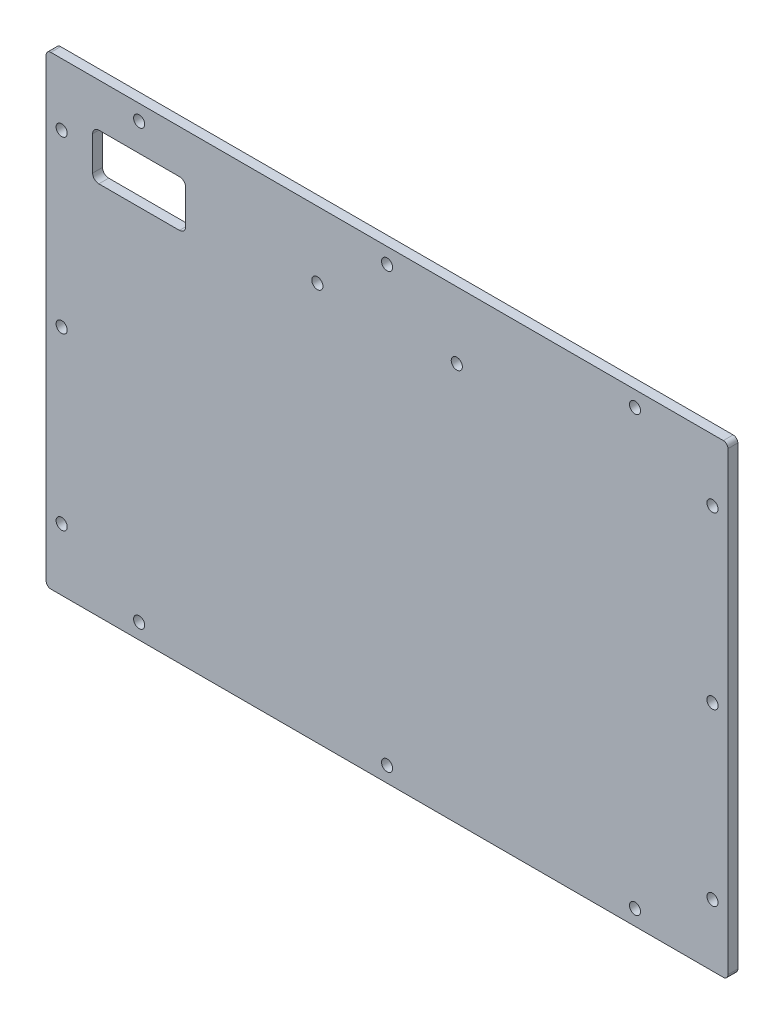
ISO-10303-21;
HEADER;
FILE_DESCRIPTION(('STEP AP214'),'2;1');
FILE_NAME('part.step','',(''),(''),'','','');
FILE_SCHEMA(('AUTOMOTIVE_DESIGN { 1 0 10303 214 1 1 1 1 }'));
ENDSEC;
DATA;
#1=APPLICATION_CONTEXT('core data for automotive mechanical design processes');
#2=APPLICATION_PROTOCOL_DEFINITION('international standard','automotive_design',2000,#1);
#3=PRODUCT_CONTEXT('',#1,'mechanical');
#4=PRODUCT('Part','Part','',(#3));
#5=PRODUCT_RELATED_PRODUCT_CATEGORY('part','',(#4));
#6=PRODUCT_DEFINITION_FORMATION('','',#4);
#7=PRODUCT_DEFINITION_CONTEXT('part definition',#1,'design');
#8=PRODUCT_DEFINITION('design','',#6,#7);
#9=PRODUCT_DEFINITION_SHAPE('','',#8);
#10=(LENGTH_UNIT() NAMED_UNIT(*) SI_UNIT(.MILLI.,.METRE.));
#11=(NAMED_UNIT(*) PLANE_ANGLE_UNIT() SI_UNIT($,.RADIAN.));
#12=(NAMED_UNIT(*) SI_UNIT($,.STERADIAN.) SOLID_ANGLE_UNIT());
#13=UNCERTAINTY_MEASURE_WITH_UNIT(LENGTH_MEASURE(1.E-05),#10,'distance_accuracy_value','');
#14=(GEOMETRIC_REPRESENTATION_CONTEXT(3) GLOBAL_UNCERTAINTY_ASSIGNED_CONTEXT((#13)) GLOBAL_UNIT_ASSIGNED_CONTEXT((#10,
#11,#12)) REPRESENTATION_CONTEXT('',''));
#15=CARTESIAN_POINT('',(0.,0.,0.));
#16=DIRECTION('',(0.,0.,1.));
#17=DIRECTION('',(1.,0.,0.));
#18=AXIS2_PLACEMENT_3D('',#15,#16,#17);
#19=CARTESIAN_POINT('',(0.,-75.,3.175));
#20=DIRECTION('',(0.,1.,0.));
#21=DIRECTION('',(0.,0.,1.));
#22=AXIS2_PLACEMENT_3D('',#19,#20,#21);
#23=PLANE('',#22);
#24=DIRECTION('',(1.,0.,0.));
#25=VECTOR('',#24,1.);
#26=CARTESIAN_POINT('',(0.,-75.,3.175));
#27=LINE('',#26,#25);
#28=CARTESIAN_POINT('',(-108.5,-75.,3.175));
#29=VERTEX_POINT('',#28);
#30=CARTESIAN_POINT('',(108.5,-75.,3.175));
#31=VERTEX_POINT('',#30);
#32=EDGE_CURVE('E171',#29,#31,#27,.T.);
#33=ORIENTED_EDGE('',*,*,#32,.F.);
#34=DIRECTION('',(0.,0.,-1.));
#35=VECTOR('',#34,1.);
#36=CARTESIAN_POINT('',(-108.5,-75.,0.));
#37=LINE('',#36,#35);
#38=CARTESIAN_POINT('',(-108.5,-75.,0.));
#39=VERTEX_POINT('',#38);
#40=EDGE_CURVE('E156',#29,#39,#37,.T.);
#41=ORIENTED_EDGE('',*,*,#40,.T.);
#42=DIRECTION('',(1.,0.,0.));
#43=VECTOR('',#42,1.);
#44=CARTESIAN_POINT('',(0.,-75.,0.));
#45=LINE('',#44,#43);
#46=CARTESIAN_POINT('',(108.5,-75.,0.));
#47=VERTEX_POINT('',#46);
#48=EDGE_CURVE('E168',#39,#47,#45,.T.);
#49=ORIENTED_EDGE('',*,*,#48,.T.);
#50=DIRECTION('',(0.,0.,-1.));
#51=VECTOR('',#50,1.);
#52=CARTESIAN_POINT('',(108.5,-75.,3.175));
#53=LINE('',#52,#51);
#54=EDGE_CURVE('E173',#47,#31,#53,.F.);
#55=ORIENTED_EDGE('',*,*,#54,.T.);
#56=EDGE_LOOP('',(#33,#41,#49,#55));
#57=FACE_BOUND('',#56,.T.);
#58=ADVANCED_FACE('F38',(#57),#23,.F.);
#59=CARTESIAN_POINT('',(110.,0.,3.175));
#60=DIRECTION('',(-1.,0.,0.));
#61=DIRECTION('',(0.,0.,1.));
#62=AXIS2_PLACEMENT_3D('',#59,#60,#61);
#63=PLANE('',#62);
#64=DIRECTION('',(0.,1.,0.));
#65=VECTOR('',#64,1.);
#66=CARTESIAN_POINT('',(110.,0.,3.175));
#67=LINE('',#66,#65);
#68=CARTESIAN_POINT('',(110.,-73.5,3.175));
#69=VERTEX_POINT('',#68);
#70=CARTESIAN_POINT('',(110.,73.5,3.175));
#71=VERTEX_POINT('',#70);
#72=EDGE_CURVE('E358',#69,#71,#67,.T.);
#73=ORIENTED_EDGE('',*,*,#72,.F.);
#74=DIRECTION('',(0.,0.,-1.));
#75=VECTOR('',#74,1.);
#76=CARTESIAN_POINT('',(110.,-73.5,3.175));
#77=LINE('',#76,#75);
#78=CARTESIAN_POINT('',(110.,-73.5,0.));
#79=VERTEX_POINT('',#78);
#80=EDGE_CURVE('E212',#69,#79,#77,.T.);
#81=ORIENTED_EDGE('',*,*,#80,.T.);
#82=DIRECTION('',(0.,1.,0.));
#83=VECTOR('',#82,1.);
#84=CARTESIAN_POINT('',(110.,0.,0.));
#85=LINE('',#84,#83);
#86=CARTESIAN_POINT('',(110.,73.5,0.));
#87=VERTEX_POINT('',#86);
#88=EDGE_CURVE('E177',#79,#87,#85,.T.);
#89=ORIENTED_EDGE('',*,*,#88,.T.);
#90=DIRECTION('',(0.,0.,-1.));
#91=VECTOR('',#90,1.);
#92=CARTESIAN_POINT('',(110.,73.5,3.175));
#93=LINE('',#92,#91);
#94=EDGE_CURVE('E210',#87,#71,#93,.F.);
#95=ORIENTED_EDGE('',*,*,#94,.T.);
#96=EDGE_LOOP('',(#73,#81,#89,#95));
#97=FACE_BOUND('',#96,.T.);
#98=ADVANCED_FACE('F383',(#97),#63,.F.);
#99=CARTESIAN_POINT('',(0.,75.,3.175));
#100=DIRECTION('',(0.,1.,0.));
#101=DIRECTION('',(0.,0.,1.));
#102=AXIS2_PLACEMENT_3D('',#99,#100,#101);
#103=PLANE('',#102);
#104=DIRECTION('',(1.,0.,0.));
#105=VECTOR('',#104,1.);
#106=CARTESIAN_POINT('',(0.,75.,3.175));
#107=LINE('',#106,#105);
#108=CARTESIAN_POINT('',(-108.5,75.,3.175));
#109=VERTEX_POINT('',#108);
#110=CARTESIAN_POINT('',(108.5,75.,3.175));
#111=VERTEX_POINT('',#110);
#112=EDGE_CURVE('E360',#109,#111,#107,.T.);
#113=ORIENTED_EDGE('',*,*,#112,.T.);
#114=DIRECTION('',(0.,0.,-1.));
#115=VECTOR('',#114,1.);
#116=CARTESIAN_POINT('',(108.5,75.,0.));
#117=LINE('',#116,#115);
#118=CARTESIAN_POINT('',(108.5,75.,0.));
#119=VERTEX_POINT('',#118);
#120=EDGE_CURVE('E217',#111,#119,#117,.T.);
#121=ORIENTED_EDGE('',*,*,#120,.T.);
#122=DIRECTION('',(1.,0.,0.));
#123=VECTOR('',#122,1.);
#124=CARTESIAN_POINT('',(0.,75.,0.));
#125=LINE('',#124,#123);
#126=CARTESIAN_POINT('',(-108.5,75.,0.));
#127=VERTEX_POINT('',#126);
#128=EDGE_CURVE('E181',#127,#119,#125,.T.);
#129=ORIENTED_EDGE('',*,*,#128,.F.);
#130=DIRECTION('',(0.,0.,-1.));
#131=VECTOR('',#130,1.);
#132=CARTESIAN_POINT('',(-108.5,75.,3.175));
#133=LINE('',#132,#131);
#134=EDGE_CURVE('E215',#127,#109,#133,.F.);
#135=ORIENTED_EDGE('',*,*,#134,.T.);
#136=EDGE_LOOP('',(#113,#121,#129,#135));
#137=FACE_BOUND('',#136,.T.);
#138=ADVANCED_FACE('F376',(#137),#103,.T.);
#139=CARTESIAN_POINT('',(-110.,0.,3.175));
#140=DIRECTION('',(-1.,0.,0.));
#141=DIRECTION('',(0.,0.,1.));
#142=AXIS2_PLACEMENT_3D('',#139,#140,#141);
#143=PLANE('',#142);
#144=DIRECTION('',(0.,1.,0.));
#145=VECTOR('',#144,1.);
#146=CARTESIAN_POINT('',(-110.,0.,0.));
#147=LINE('',#146,#145);
#148=CARTESIAN_POINT('',(-110.,-73.5,0.));
#149=VERTEX_POINT('',#148);
#150=CARTESIAN_POINT('',(-110.,73.5,0.));
#151=VERTEX_POINT('',#150);
#152=EDGE_CURVE('E192',#149,#151,#147,.T.);
#153=ORIENTED_EDGE('',*,*,#152,.F.);
#154=DIRECTION('',(0.,0.,-1.));
#155=VECTOR('',#154,1.);
#156=CARTESIAN_POINT('',(-110.,-73.5,3.175));
#157=LINE('',#156,#155);
#158=CARTESIAN_POINT('',(-110.,-73.5,3.175));
#159=VERTEX_POINT('',#158);
#160=EDGE_CURVE('E157',#149,#159,#157,.F.);
#161=ORIENTED_EDGE('',*,*,#160,.T.);
#162=DIRECTION('',(0.,1.,0.));
#163=VECTOR('',#162,1.);
#164=CARTESIAN_POINT('',(-110.,0.,3.175));
#165=LINE('',#164,#163);
#166=CARTESIAN_POINT('',(-110.,73.5,3.175));
#167=VERTEX_POINT('',#166);
#168=EDGE_CURVE('E187',#159,#167,#165,.T.);
#169=ORIENTED_EDGE('',*,*,#168,.T.);
#170=DIRECTION('',(0.,0.,-1.));
#171=VECTOR('',#170,1.);
#172=CARTESIAN_POINT('',(-110.,73.5,3.175));
#173=LINE('',#172,#171);
#174=EDGE_CURVE('E162',#167,#151,#173,.T.);
#175=ORIENTED_EDGE('',*,*,#174,.T.);
#176=EDGE_LOOP('',(#153,#161,#169,#175));
#177=FACE_BOUND('',#176,.T.);
#178=ADVANCED_FACE('F369',(#177),#143,.T.);
#179=CARTESIAN_POINT('',(0.,0.,3.175));
#180=DIRECTION('',(0.,0.,1.));
#181=DIRECTION('',(1.,0.,0.));
#182=AXIS2_PLACEMENT_3D('',#179,#180,#181);
#183=PLANE('',#182);
#184=CARTESIAN_POINT('',(-22.5,53.5,3.175));
#185=DIRECTION('',(0.,0.,1.));
#186=DIRECTION('',(1.,0.,0.));
#187=AXIS2_PLACEMENT_3D('',#184,#185,#186);
#188=CIRCLE('',#187,1.79999999999999);
#189=CARTESIAN_POINT('',(-20.7,53.5,3.175));
#190=VERTEX_POINT('',#189);
#191=EDGE_CURVE('E643',#190,#190,#188,.T.);
#192=ORIENTED_EDGE('',*,*,#191,.F.);
#193=EDGE_LOOP('',(#192));
#194=FACE_BOUND('',#193,.T.);
#195=CARTESIAN_POINT('',(22.5,53.5,3.175));
#196=DIRECTION('',(0.,0.,1.));
#197=DIRECTION('',(1.,0.,0.));
#198=AXIS2_PLACEMENT_3D('',#195,#196,#197);
#199=CIRCLE('',#198,1.79999999999999);
#200=CARTESIAN_POINT('',(24.3,53.5,3.175));
#201=VERTEX_POINT('',#200);
#202=EDGE_CURVE('E639',#201,#201,#199,.T.);
#203=ORIENTED_EDGE('',*,*,#202,.F.);
#204=EDGE_LOOP('',(#203));
#205=FACE_BOUND('',#204,.T.);
#206=DIRECTION('',(0.,1.,0.));
#207=VECTOR('',#206,1.);
#208=CARTESIAN_POINT('',(-65.,46.,3.175));
#209=LINE('',#208,#207);
#210=CARTESIAN_POINT('',(-65.,48.,3.175));
#211=VERTEX_POINT('',#210);
#212=CARTESIAN_POINT('',(-65.,59.,3.175));
#213=VERTEX_POINT('',#212);
#214=EDGE_CURVE('E254',#211,#213,#209,.T.);
#215=ORIENTED_EDGE('',*,*,#214,.F.);
#216=CARTESIAN_POINT('',(-67.,48.,3.175));
#217=DIRECTION('',(0.,0.,1.));
#218=DIRECTION('',(1.,0.,0.));
#219=AXIS2_PLACEMENT_3D('',#216,#217,#218);
#220=CIRCLE('',#219,2.);
#221=CARTESIAN_POINT('',(-67.,46.,3.175));
#222=VERTEX_POINT('',#221);
#223=EDGE_CURVE('E247',#211,#222,#220,.F.);
#224=ORIENTED_EDGE('',*,*,#223,.T.);
#225=DIRECTION('',(1.,0.,0.));
#226=VECTOR('',#225,1.);
#227=CARTESIAN_POINT('',(-95.,46.,3.175));
#228=LINE('',#227,#226);
#229=CARTESIAN_POINT('',(-93.,46.,3.175));
#230=VERTEX_POINT('',#229);
#231=EDGE_CURVE('E278',#230,#222,#228,.T.);
#232=ORIENTED_EDGE('',*,*,#231,.F.);
#233=CARTESIAN_POINT('',(-93.,48.,3.175));
#234=DIRECTION('',(0.,0.,1.));
#235=DIRECTION('',(1.,0.,0.));
#236=AXIS2_PLACEMENT_3D('',#233,#234,#235);
#237=CIRCLE('',#236,2.);
#238=CARTESIAN_POINT('',(-95.,48.,3.175));
#239=VERTEX_POINT('',#238);
#240=EDGE_CURVE('E243',#230,#239,#237,.F.);
#241=ORIENTED_EDGE('',*,*,#240,.T.);
#242=DIRECTION('',(0.,-1.,0.));
#243=VECTOR('',#242,1.);
#244=CARTESIAN_POINT('',(-95.,46.,3.175));
#245=LINE('',#244,#243);
#246=CARTESIAN_POINT('',(-95.,59.,3.175));
#247=VERTEX_POINT('',#246);
#248=EDGE_CURVE('E285',#247,#239,#245,.T.);
#249=ORIENTED_EDGE('',*,*,#248,.F.);
#250=CARTESIAN_POINT('',(-93.,59.,3.175));
#251=DIRECTION('',(0.,0.,1.));
#252=DIRECTION('',(1.,0.,0.));
#253=AXIS2_PLACEMENT_3D('',#250,#251,#252);
#254=CIRCLE('',#253,2.);
#255=CARTESIAN_POINT('',(-93.,61.,3.175));
#256=VERTEX_POINT('',#255);
#257=EDGE_CURVE('E239',#247,#256,#254,.F.);
#258=ORIENTED_EDGE('',*,*,#257,.T.);
#259=DIRECTION('',(-1.,0.,0.));
#260=VECTOR('',#259,1.);
#261=CARTESIAN_POINT('',(-95.,61.,3.175));
#262=LINE('',#261,#260);
#263=CARTESIAN_POINT('',(-67.,61.,3.175));
#264=VERTEX_POINT('',#263);
#265=EDGE_CURVE('E256',#264,#256,#262,.T.);
#266=ORIENTED_EDGE('',*,*,#265,.F.);
#267=CARTESIAN_POINT('',(-67.,59.,3.175));
#268=DIRECTION('',(0.,0.,1.));
#269=DIRECTION('',(1.,0.,0.));
#270=AXIS2_PLACEMENT_3D('',#267,#268,#269);
#271=CIRCLE('',#270,2.);
#272=EDGE_CURVE('E46',#264,#213,#271,.F.);
#273=ORIENTED_EDGE('',*,*,#272,.T.);
#274=EDGE_LOOP('',(#215,#224,#232,#241,#249,#258,#266,#273));
#275=FACE_BOUND('',#274,.T.);
#276=CARTESIAN_POINT('',(-80.,70.,3.175));
#277=DIRECTION('',(0.,0.,1.));
#278=DIRECTION('',(1.,0.,0.));
#279=AXIS2_PLACEMENT_3D('',#276,#277,#278);
#280=CIRCLE('',#279,1.8);
#281=CARTESIAN_POINT('',(-78.2,70.,3.175));
#282=VERTEX_POINT('',#281);
#283=EDGE_CURVE('E282',#282,#282,#280,.T.);
#284=ORIENTED_EDGE('',*,*,#283,.F.);
#285=EDGE_LOOP('',(#284));
#286=FACE_BOUND('',#285,.T.);
#287=CARTESIAN_POINT('',(80.,70.,3.175));
#288=DIRECTION('',(0.,0.,1.));
#289=DIRECTION('',(1.,0.,0.));
#290=AXIS2_PLACEMENT_3D('',#287,#288,#289);
#291=CIRCLE('',#290,1.8);
#292=CARTESIAN_POINT('',(81.8,70.,3.175));
#293=VERTEX_POINT('',#292);
#294=EDGE_CURVE('E295',#293,#293,#291,.T.);
#295=ORIENTED_EDGE('',*,*,#294,.F.);
#296=EDGE_LOOP('',(#295));
#297=FACE_BOUND('',#296,.T.);
#298=CARTESIAN_POINT('',(0.,70.,3.175));
#299=DIRECTION('',(0.,0.,1.));
#300=DIRECTION('',(1.,0.,0.));
#301=AXIS2_PLACEMENT_3D('',#298,#299,#300);
#302=CIRCLE('',#301,1.8);
#303=CARTESIAN_POINT('',(1.8,70.,3.175));
#304=VERTEX_POINT('',#303);
#305=EDGE_CURVE('E301',#304,#304,#302,.T.);
#306=ORIENTED_EDGE('',*,*,#305,.F.);
#307=EDGE_LOOP('',(#306));
#308=FACE_BOUND('',#307,.T.);
#309=CARTESIAN_POINT('',(-105.,55.,3.175));
#310=DIRECTION('',(0.,0.,1.));
#311=DIRECTION('',(1.,0.,0.));
#312=AXIS2_PLACEMENT_3D('',#309,#310,#311);
#313=CIRCLE('',#312,1.8);
#314=CARTESIAN_POINT('',(-103.2,55.,3.175));
#315=VERTEX_POINT('',#314);
#316=EDGE_CURVE('E307',#315,#315,#313,.T.);
#317=ORIENTED_EDGE('',*,*,#316,.F.);
#318=EDGE_LOOP('',(#317));
#319=FACE_BOUND('',#318,.T.);
#320=CARTESIAN_POINT('',(-105.,0.,3.175));
#321=DIRECTION('',(0.,0.,1.));
#322=DIRECTION('',(1.,0.,0.));
#323=AXIS2_PLACEMENT_3D('',#320,#321,#322);
#324=CIRCLE('',#323,1.8);
#325=CARTESIAN_POINT('',(-103.2,0.,3.175));
#326=VERTEX_POINT('',#325);
#327=EDGE_CURVE('E313',#326,#326,#324,.T.);
#328=ORIENTED_EDGE('',*,*,#327,.F.);
#329=EDGE_LOOP('',(#328));
#330=FACE_BOUND('',#329,.T.);
#331=CARTESIAN_POINT('',(-105.,-55.,3.175));
#332=DIRECTION('',(0.,0.,1.));
#333=DIRECTION('',(1.,0.,0.));
#334=AXIS2_PLACEMENT_3D('',#331,#332,#333);
#335=CIRCLE('',#334,1.8);
#336=CARTESIAN_POINT('',(-103.2,-55.,3.175));
#337=VERTEX_POINT('',#336);
#338=EDGE_CURVE('E319',#337,#337,#335,.T.);
#339=ORIENTED_EDGE('',*,*,#338,.F.);
#340=EDGE_LOOP('',(#339));
#341=FACE_BOUND('',#340,.T.);
#342=CARTESIAN_POINT('',(-80.,-70.,3.175));
#343=DIRECTION('',(0.,0.,1.));
#344=DIRECTION('',(1.,0.,0.));
#345=AXIS2_PLACEMENT_3D('',#342,#343,#344);
#346=CIRCLE('',#345,1.8);
#347=CARTESIAN_POINT('',(-78.2,-70.,3.175));
#348=VERTEX_POINT('',#347);
#349=EDGE_CURVE('E325',#348,#348,#346,.T.);
#350=ORIENTED_EDGE('',*,*,#349,.F.);
#351=EDGE_LOOP('',(#350));
#352=FACE_BOUND('',#351,.T.);
#353=CARTESIAN_POINT('',(0.,-70.,3.175));
#354=DIRECTION('',(0.,0.,1.));
#355=DIRECTION('',(1.,0.,0.));
#356=AXIS2_PLACEMENT_3D('',#353,#354,#355);
#357=CIRCLE('',#356,1.8);
#358=CARTESIAN_POINT('',(1.80000000000003,-70.,3.175));
#359=VERTEX_POINT('',#358);
#360=EDGE_CURVE('E331',#359,#359,#357,.T.);
#361=ORIENTED_EDGE('',*,*,#360,.F.);
#362=EDGE_LOOP('',(#361));
#363=FACE_BOUND('',#362,.T.);
#364=CARTESIAN_POINT('',(80.,-69.9999999999999,3.175));
#365=DIRECTION('',(0.,0.,1.));
#366=DIRECTION('',(1.,0.,0.));
#367=AXIS2_PLACEMENT_3D('',#364,#365,#366);
#368=CIRCLE('',#367,1.8);
#369=CARTESIAN_POINT('',(81.8,-69.9999999999999,3.175));
#370=VERTEX_POINT('',#369);
#371=EDGE_CURVE('E337',#370,#370,#368,.T.);
#372=ORIENTED_EDGE('',*,*,#371,.F.);
#373=EDGE_LOOP('',(#372));
#374=FACE_BOUND('',#373,.T.);
#375=CARTESIAN_POINT('',(105.,-55.,3.175));
#376=DIRECTION('',(0.,0.,1.));
#377=DIRECTION('',(1.,0.,0.));
#378=AXIS2_PLACEMENT_3D('',#375,#376,#377);
#379=CIRCLE('',#378,1.8);
#380=CARTESIAN_POINT('',(106.8,-55.,3.175));
#381=VERTEX_POINT('',#380);
#382=EDGE_CURVE('E343',#381,#381,#379,.T.);
#383=ORIENTED_EDGE('',*,*,#382,.F.);
#384=EDGE_LOOP('',(#383));
#385=FACE_BOUND('',#384,.T.);
#386=CARTESIAN_POINT('',(105.,0.,3.175));
#387=DIRECTION('',(0.,0.,1.));
#388=DIRECTION('',(1.,0.,0.));
#389=AXIS2_PLACEMENT_3D('',#386,#387,#388);
#390=CIRCLE('',#389,1.8);
#391=CARTESIAN_POINT('',(106.8,0.,3.175));
#392=VERTEX_POINT('',#391);
#393=EDGE_CURVE('E349',#392,#392,#390,.T.);
#394=ORIENTED_EDGE('',*,*,#393,.F.);
#395=EDGE_LOOP('',(#394));
#396=FACE_BOUND('',#395,.T.);
#397=CARTESIAN_POINT('',(105.,55.,3.175));
#398=DIRECTION('',(0.,0.,1.));
#399=DIRECTION('',(1.,0.,0.));
#400=AXIS2_PLACEMENT_3D('',#397,#398,#399);
#401=CIRCLE('',#400,1.8);
#402=CARTESIAN_POINT('',(106.8,55.,3.175));
#403=VERTEX_POINT('',#402);
#404=EDGE_CURVE('E184',#403,#403,#401,.T.);
#405=ORIENTED_EDGE('',*,*,#404,.F.);
#406=EDGE_LOOP('',(#405));
#407=FACE_BOUND('',#406,.T.);
#408=ORIENTED_EDGE('',*,*,#168,.F.);
#409=CARTESIAN_POINT('',(-108.5,-73.5,3.175));
#410=DIRECTION('',(0.,0.,1.));
#411=DIRECTION('',(1.,0.,0.));
#412=AXIS2_PLACEMENT_3D('',#409,#410,#411);
#413=CIRCLE('',#412,1.5);
#414=EDGE_CURVE('E208',#159,#29,#413,.T.);
#415=ORIENTED_EDGE('',*,*,#414,.T.);
#416=ORIENTED_EDGE('',*,*,#32,.T.);
#417=CARTESIAN_POINT('',(108.5,-73.5,3.175));
#418=DIRECTION('',(0.,0.,1.));
#419=DIRECTION('',(1.,0.,0.));
#420=AXIS2_PLACEMENT_3D('',#417,#418,#419);
#421=CIRCLE('',#420,1.5);
#422=EDGE_CURVE('E206',#31,#69,#421,.T.);
#423=ORIENTED_EDGE('',*,*,#422,.T.);
#424=ORIENTED_EDGE('',*,*,#72,.T.);
#425=CARTESIAN_POINT('',(108.5,73.5,3.175));
#426=DIRECTION('',(0.,0.,1.));
#427=DIRECTION('',(1.,0.,0.));
#428=AXIS2_PLACEMENT_3D('',#425,#426,#427);
#429=CIRCLE('',#428,1.5);
#430=EDGE_CURVE('E204',#71,#111,#429,.T.);
#431=ORIENTED_EDGE('',*,*,#430,.T.);
#432=ORIENTED_EDGE('',*,*,#112,.F.);
#433=CARTESIAN_POINT('',(-108.5,73.5,3.175));
#434=DIRECTION('',(0.,0.,1.));
#435=DIRECTION('',(1.,0.,0.));
#436=AXIS2_PLACEMENT_3D('',#433,#434,#435);
#437=CIRCLE('',#436,1.5);
#438=EDGE_CURVE('E202',#109,#167,#437,.T.);
#439=ORIENTED_EDGE('',*,*,#438,.T.);
#440=EDGE_LOOP('',(#408,#415,#416,#423,#424,#431,#432,#439));
#441=FACE_BOUND('',#440,.T.);
#442=ADVANCED_FACE('F252',(#194,#205,#275,#286,#297,#308,#319,#330,#341,#352,#363,#374,#385,
#396,#407,#441),#183,.T.);
#443=CARTESIAN_POINT('',(0.,0.,0.));
#444=DIRECTION('',(0.,0.,1.));
#445=DIRECTION('',(1.,0.,0.));
#446=AXIS2_PLACEMENT_3D('',#443,#444,#445);
#447=PLANE('',#446);
#448=CARTESIAN_POINT('',(-22.5,53.5,0.));
#449=DIRECTION('',(0.,0.,1.));
#450=DIRECTION('',(1.,0.,0.));
#451=AXIS2_PLACEMENT_3D('',#448,#449,#450);
#452=CIRCLE('',#451,1.8);
#453=CARTESIAN_POINT('',(-20.7,53.5,0.));
#454=VERTEX_POINT('',#453);
#455=EDGE_CURVE('E640',#454,#454,#452,.T.);
#456=ORIENTED_EDGE('',*,*,#455,.T.);
#457=EDGE_LOOP('',(#456));
#458=FACE_BOUND('',#457,.T.);
#459=CARTESIAN_POINT('',(22.5,53.5,0.));
#460=DIRECTION('',(0.,0.,1.));
#461=DIRECTION('',(1.,0.,0.));
#462=AXIS2_PLACEMENT_3D('',#459,#460,#461);
#463=CIRCLE('',#462,1.8);
#464=CARTESIAN_POINT('',(24.3,53.5,0.));
#465=VERTEX_POINT('',#464);
#466=EDGE_CURVE('E261',#465,#465,#463,.T.);
#467=ORIENTED_EDGE('',*,*,#466,.T.);
#468=EDGE_LOOP('',(#467));
#469=FACE_BOUND('',#468,.T.);
#470=DIRECTION('',(0.,-1.,0.));
#471=VECTOR('',#470,1.);
#472=CARTESIAN_POINT('',(-95.,46.,0.));
#473=LINE('',#472,#471);
#474=CARTESIAN_POINT('',(-95.,59.,0.));
#475=VERTEX_POINT('',#474);
#476=CARTESIAN_POINT('',(-95.,48.,0.));
#477=VERTEX_POINT('',#476);
#478=EDGE_CURVE('E274',#475,#477,#473,.T.);
#479=ORIENTED_EDGE('',*,*,#478,.T.);
#480=CARTESIAN_POINT('',(-93.,48.,0.));
#481=DIRECTION('',(0.,0.,1.));
#482=DIRECTION('',(1.,0.,0.));
#483=AXIS2_PLACEMENT_3D('',#480,#481,#482);
#484=CIRCLE('',#483,2.);
#485=CARTESIAN_POINT('',(-93.,46.,0.));
#486=VERTEX_POINT('',#485);
#487=EDGE_CURVE('E245',#477,#486,#484,.T.);
#488=ORIENTED_EDGE('',*,*,#487,.T.);
#489=DIRECTION('',(1.,0.,0.));
#490=VECTOR('',#489,1.);
#491=CARTESIAN_POINT('',(-95.,46.,0.));
#492=LINE('',#491,#490);
#493=CARTESIAN_POINT('',(-67.,46.,0.));
#494=VERTEX_POINT('',#493);
#495=EDGE_CURVE('E276',#486,#494,#492,.T.);
#496=ORIENTED_EDGE('',*,*,#495,.T.);
#497=CARTESIAN_POINT('',(-67.,48.,0.));
#498=DIRECTION('',(0.,0.,1.));
#499=DIRECTION('',(1.,0.,0.));
#500=AXIS2_PLACEMENT_3D('',#497,#498,#499);
#501=CIRCLE('',#500,2.);
#502=CARTESIAN_POINT('',(-65.,48.,0.));
#503=VERTEX_POINT('',#502);
#504=EDGE_CURVE('E60',#494,#503,#501,.T.);
#505=ORIENTED_EDGE('',*,*,#504,.T.);
#506=DIRECTION('',(0.,1.,0.));
#507=VECTOR('',#506,1.);
#508=CARTESIAN_POINT('',(-65.,46.,0.));
#509=LINE('',#508,#507);
#510=CARTESIAN_POINT('',(-65.,59.,0.));
#511=VERTEX_POINT('',#510);
#512=EDGE_CURVE('E270',#503,#511,#509,.T.);
#513=ORIENTED_EDGE('',*,*,#512,.T.);
#514=CARTESIAN_POINT('',(-67.,59.,0.));
#515=DIRECTION('',(0.,0.,1.));
#516=DIRECTION('',(1.,0.,0.));
#517=AXIS2_PLACEMENT_3D('',#514,#515,#516);
#518=CIRCLE('',#517,2.);
#519=CARTESIAN_POINT('',(-67.,61.,0.));
#520=VERTEX_POINT('',#519);
#521=EDGE_CURVE('E11',#511,#520,#518,.T.);
#522=ORIENTED_EDGE('',*,*,#521,.T.);
#523=DIRECTION('',(-1.,0.,0.));
#524=VECTOR('',#523,1.);
#525=CARTESIAN_POINT('',(-95.,61.,0.));
#526=LINE('',#525,#524);
#527=CARTESIAN_POINT('',(-93.,61.,0.));
#528=VERTEX_POINT('',#527);
#529=EDGE_CURVE('E268',#520,#528,#526,.T.);
#530=ORIENTED_EDGE('',*,*,#529,.T.);
#531=CARTESIAN_POINT('',(-93.,59.,0.));
#532=DIRECTION('',(0.,0.,1.));
#533=DIRECTION('',(1.,0.,0.));
#534=AXIS2_PLACEMENT_3D('',#531,#532,#533);
#535=CIRCLE('',#534,2.);
#536=EDGE_CURVE('E241',#528,#475,#535,.T.);
#537=ORIENTED_EDGE('',*,*,#536,.T.);
#538=EDGE_LOOP('',(#479,#488,#496,#505,#513,#522,#530,#537));
#539=FACE_BOUND('',#538,.T.);
#540=CARTESIAN_POINT('',(-80.,70.,0.));
#541=DIRECTION('',(0.,0.,1.));
#542=DIRECTION('',(1.,0.,0.));
#543=AXIS2_PLACEMENT_3D('',#540,#541,#542);
#544=CIRCLE('',#543,1.8);
#545=CARTESIAN_POINT('',(-78.2,70.,0.));
#546=VERTEX_POINT('',#545);
#547=EDGE_CURVE('E292',#546,#546,#544,.T.);
#548=ORIENTED_EDGE('',*,*,#547,.T.);
#549=EDGE_LOOP('',(#548));
#550=FACE_BOUND('',#549,.T.);
#551=CARTESIAN_POINT('',(80.,70.,0.));
#552=DIRECTION('',(0.,0.,1.));
#553=DIRECTION('',(1.,0.,0.));
#554=AXIS2_PLACEMENT_3D('',#551,#552,#553);
#555=CIRCLE('',#554,1.8);
#556=CARTESIAN_POINT('',(81.8,70.,0.));
#557=VERTEX_POINT('',#556);
#558=EDGE_CURVE('E298',#557,#557,#555,.T.);
#559=ORIENTED_EDGE('',*,*,#558,.T.);
#560=EDGE_LOOP('',(#559));
#561=FACE_BOUND('',#560,.T.);
#562=CARTESIAN_POINT('',(0.,70.,0.));
#563=DIRECTION('',(0.,0.,1.));
#564=DIRECTION('',(1.,0.,0.));
#565=AXIS2_PLACEMENT_3D('',#562,#563,#564);
#566=CIRCLE('',#565,1.8);
#567=CARTESIAN_POINT('',(1.8,70.,0.));
#568=VERTEX_POINT('',#567);
#569=EDGE_CURVE('E304',#568,#568,#566,.T.);
#570=ORIENTED_EDGE('',*,*,#569,.T.);
#571=EDGE_LOOP('',(#570));
#572=FACE_BOUND('',#571,.T.);
#573=CARTESIAN_POINT('',(-105.,55.,0.));
#574=DIRECTION('',(0.,0.,1.));
#575=DIRECTION('',(1.,0.,0.));
#576=AXIS2_PLACEMENT_3D('',#573,#574,#575);
#577=CIRCLE('',#576,1.8);
#578=CARTESIAN_POINT('',(-103.2,55.,0.));
#579=VERTEX_POINT('',#578);
#580=EDGE_CURVE('E310',#579,#579,#577,.T.);
#581=ORIENTED_EDGE('',*,*,#580,.T.);
#582=EDGE_LOOP('',(#581));
#583=FACE_BOUND('',#582,.T.);
#584=CARTESIAN_POINT('',(-105.,0.,0.));
#585=DIRECTION('',(0.,0.,1.));
#586=DIRECTION('',(1.,0.,0.));
#587=AXIS2_PLACEMENT_3D('',#584,#585,#586);
#588=CIRCLE('',#587,1.8);
#589=CARTESIAN_POINT('',(-103.2,0.,0.));
#590=VERTEX_POINT('',#589);
#591=EDGE_CURVE('E316',#590,#590,#588,.T.);
#592=ORIENTED_EDGE('',*,*,#591,.T.);
#593=EDGE_LOOP('',(#592));
#594=FACE_BOUND('',#593,.T.);
#595=CARTESIAN_POINT('',(-105.,-55.,0.));
#596=DIRECTION('',(0.,0.,1.));
#597=DIRECTION('',(1.,0.,0.));
#598=AXIS2_PLACEMENT_3D('',#595,#596,#597);
#599=CIRCLE('',#598,1.8);
#600=CARTESIAN_POINT('',(-103.2,-55.,0.));
#601=VERTEX_POINT('',#600);
#602=EDGE_CURVE('E322',#601,#601,#599,.T.);
#603=ORIENTED_EDGE('',*,*,#602,.T.);
#604=EDGE_LOOP('',(#603));
#605=FACE_BOUND('',#604,.T.);
#606=CARTESIAN_POINT('',(-80.,-70.,0.));
#607=DIRECTION('',(0.,0.,1.));
#608=DIRECTION('',(1.,0.,0.));
#609=AXIS2_PLACEMENT_3D('',#606,#607,#608);
#610=CIRCLE('',#609,1.8);
#611=CARTESIAN_POINT('',(-78.2,-70.,0.));
#612=VERTEX_POINT('',#611);
#613=EDGE_CURVE('E328',#612,#612,#610,.T.);
#614=ORIENTED_EDGE('',*,*,#613,.T.);
#615=EDGE_LOOP('',(#614));
#616=FACE_BOUND('',#615,.T.);
#617=CARTESIAN_POINT('',(0.,-70.,0.));
#618=DIRECTION('',(0.,0.,1.));
#619=DIRECTION('',(1.,0.,0.));
#620=AXIS2_PLACEMENT_3D('',#617,#618,#619);
#621=CIRCLE('',#620,1.8);
#622=CARTESIAN_POINT('',(1.80000000000003,-70.,0.));
#623=VERTEX_POINT('',#622);
#624=EDGE_CURVE('E334',#623,#623,#621,.T.);
#625=ORIENTED_EDGE('',*,*,#624,.T.);
#626=EDGE_LOOP('',(#625));
#627=FACE_BOUND('',#626,.T.);
#628=CARTESIAN_POINT('',(80.,-69.9999999999999,0.));
#629=DIRECTION('',(0.,0.,1.));
#630=DIRECTION('',(1.,0.,0.));
#631=AXIS2_PLACEMENT_3D('',#628,#629,#630);
#632=CIRCLE('',#631,1.8);
#633=CARTESIAN_POINT('',(81.8,-69.9999999999999,0.));
#634=VERTEX_POINT('',#633);
#635=EDGE_CURVE('E340',#634,#634,#632,.T.);
#636=ORIENTED_EDGE('',*,*,#635,.T.);
#637=EDGE_LOOP('',(#636));
#638=FACE_BOUND('',#637,.T.);
#639=CARTESIAN_POINT('',(105.,-55.,0.));
#640=DIRECTION('',(0.,0.,1.));
#641=DIRECTION('',(1.,0.,0.));
#642=AXIS2_PLACEMENT_3D('',#639,#640,#641);
#643=CIRCLE('',#642,1.8);
#644=CARTESIAN_POINT('',(106.8,-55.,0.));
#645=VERTEX_POINT('',#644);
#646=EDGE_CURVE('E346',#645,#645,#643,.T.);
#647=ORIENTED_EDGE('',*,*,#646,.T.);
#648=EDGE_LOOP('',(#647));
#649=FACE_BOUND('',#648,.T.);
#650=CARTESIAN_POINT('',(105.,0.,0.));
#651=DIRECTION('',(0.,0.,1.));
#652=DIRECTION('',(1.,0.,0.));
#653=AXIS2_PLACEMENT_3D('',#650,#651,#652);
#654=CIRCLE('',#653,1.8);
#655=CARTESIAN_POINT('',(106.8,0.,0.));
#656=VERTEX_POINT('',#655);
#657=EDGE_CURVE('E352',#656,#656,#654,.T.);
#658=ORIENTED_EDGE('',*,*,#657,.T.);
#659=EDGE_LOOP('',(#658));
#660=FACE_BOUND('',#659,.T.);
#661=CARTESIAN_POINT('',(105.,55.,0.));
#662=DIRECTION('',(0.,0.,1.));
#663=DIRECTION('',(1.,0.,0.));
#664=AXIS2_PLACEMENT_3D('',#661,#662,#663);
#665=CIRCLE('',#664,1.8);
#666=CARTESIAN_POINT('',(106.8,55.,0.));
#667=VERTEX_POINT('',#666);
#668=EDGE_CURVE('E178',#667,#667,#665,.T.);
#669=ORIENTED_EDGE('',*,*,#668,.T.);
#670=EDGE_LOOP('',(#669));
#671=FACE_BOUND('',#670,.T.);
#672=ORIENTED_EDGE('',*,*,#48,.F.);
#673=CARTESIAN_POINT('',(-108.5,-73.5,0.));
#674=DIRECTION('',(0.,0.,1.));
#675=DIRECTION('',(1.,0.,0.));
#676=AXIS2_PLACEMENT_3D('',#673,#674,#675);
#677=CIRCLE('',#676,1.5);
#678=EDGE_CURVE('E152',#39,#149,#677,.F.);
#679=ORIENTED_EDGE('',*,*,#678,.T.);
#680=ORIENTED_EDGE('',*,*,#152,.T.);
#681=CARTESIAN_POINT('',(-108.5,73.5,0.));
#682=DIRECTION('',(0.,0.,1.));
#683=DIRECTION('',(1.,0.,0.));
#684=AXIS2_PLACEMENT_3D('',#681,#682,#683);
#685=CIRCLE('',#684,1.5);
#686=EDGE_CURVE('E172',#151,#127,#685,.F.);
#687=ORIENTED_EDGE('',*,*,#686,.T.);
#688=ORIENTED_EDGE('',*,*,#128,.T.);
#689=CARTESIAN_POINT('',(108.5,73.5,0.));
#690=DIRECTION('',(0.,0.,1.));
#691=DIRECTION('',(1.,0.,0.));
#692=AXIS2_PLACEMENT_3D('',#689,#690,#691);
#693=CIRCLE('',#692,1.5);
#694=EDGE_CURVE('E196',#119,#87,#693,.F.);
#695=ORIENTED_EDGE('',*,*,#694,.T.);
#696=ORIENTED_EDGE('',*,*,#88,.F.);
#697=CARTESIAN_POINT('',(108.5,-73.5,0.));
#698=DIRECTION('',(0.,0.,1.));
#699=DIRECTION('',(1.,0.,0.));
#700=AXIS2_PLACEMENT_3D('',#697,#698,#699);
#701=CIRCLE('',#700,1.5);
#702=EDGE_CURVE('E163',#79,#47,#701,.F.);
#703=ORIENTED_EDGE('',*,*,#702,.T.);
#704=EDGE_LOOP('',(#672,#679,#680,#687,#688,#695,#696,#703));
#705=FACE_BOUND('',#704,.T.);
#706=ADVANCED_FACE('F175',(#458,#469,#539,#550,#561,#572,#583,#594,#605,#616,#627,#638,#649,
#660,#671,#705),#447,.F.);
#707=CARTESIAN_POINT('',(105.,55.,3.175));
#708=DIRECTION('',(0.,0.,1.));
#709=DIRECTION('',(1.,0.,0.));
#710=AXIS2_PLACEMENT_3D('',#707,#708,#709);
#711=CYLINDRICAL_SURFACE('',#710,1.8);
#712=ORIENTED_EDGE('',*,*,#668,.F.);
#713=EDGE_LOOP('',(#712));
#714=FACE_BOUND('',#713,.T.);
#715=ORIENTED_EDGE('',*,*,#404,.T.);
#716=EDGE_LOOP('',(#715));
#717=FACE_BOUND('',#716,.T.);
#718=ADVANCED_FACE('F395',(#714,#717),#711,.F.);
#719=CARTESIAN_POINT('',(105.,0.,3.175));
#720=DIRECTION('',(0.,0.,1.));
#721=DIRECTION('',(1.,0.,0.));
#722=AXIS2_PLACEMENT_3D('',#719,#720,#721);
#723=CYLINDRICAL_SURFACE('',#722,1.8);
#724=ORIENTED_EDGE('',*,*,#657,.F.);
#725=EDGE_LOOP('',(#724));
#726=FACE_BOUND('',#725,.T.);
#727=ORIENTED_EDGE('',*,*,#393,.T.);
#728=EDGE_LOOP('',(#727));
#729=FACE_BOUND('',#728,.T.);
#730=ADVANCED_FACE('F497',(#726,#729),#723,.F.);
#731=CARTESIAN_POINT('',(105.,-55.,3.175));
#732=DIRECTION('',(0.,0.,1.));
#733=DIRECTION('',(1.,0.,0.));
#734=AXIS2_PLACEMENT_3D('',#731,#732,#733);
#735=CYLINDRICAL_SURFACE('',#734,1.8);
#736=ORIENTED_EDGE('',*,*,#646,.F.);
#737=EDGE_LOOP('',(#736));
#738=FACE_BOUND('',#737,.T.);
#739=ORIENTED_EDGE('',*,*,#382,.T.);
#740=EDGE_LOOP('',(#739));
#741=FACE_BOUND('',#740,.T.);
#742=ADVANCED_FACE('F493',(#738,#741),#735,.F.);
#743=CARTESIAN_POINT('',(80.,-69.9999999999999,3.175));
#744=DIRECTION('',(0.,0.,1.));
#745=DIRECTION('',(1.,0.,0.));
#746=AXIS2_PLACEMENT_3D('',#743,#744,#745);
#747=CYLINDRICAL_SURFACE('',#746,1.8);
#748=ORIENTED_EDGE('',*,*,#635,.F.);
#749=EDGE_LOOP('',(#748));
#750=FACE_BOUND('',#749,.T.);
#751=ORIENTED_EDGE('',*,*,#371,.T.);
#752=EDGE_LOOP('',(#751));
#753=FACE_BOUND('',#752,.T.);
#754=ADVANCED_FACE('F489',(#750,#753),#747,.F.);
#755=CARTESIAN_POINT('',(0.,-70.,3.175));
#756=DIRECTION('',(0.,0.,1.));
#757=DIRECTION('',(1.,0.,0.));
#758=AXIS2_PLACEMENT_3D('',#755,#756,#757);
#759=CYLINDRICAL_SURFACE('',#758,1.8);
#760=ORIENTED_EDGE('',*,*,#624,.F.);
#761=EDGE_LOOP('',(#760));
#762=FACE_BOUND('',#761,.T.);
#763=ORIENTED_EDGE('',*,*,#360,.T.);
#764=EDGE_LOOP('',(#763));
#765=FACE_BOUND('',#764,.T.);
#766=ADVANCED_FACE('F485',(#762,#765),#759,.F.);
#767=CARTESIAN_POINT('',(-80.,-70.,3.175));
#768=DIRECTION('',(0.,0.,1.));
#769=DIRECTION('',(1.,0.,0.));
#770=AXIS2_PLACEMENT_3D('',#767,#768,#769);
#771=CYLINDRICAL_SURFACE('',#770,1.8);
#772=ORIENTED_EDGE('',*,*,#613,.F.);
#773=EDGE_LOOP('',(#772));
#774=FACE_BOUND('',#773,.T.);
#775=ORIENTED_EDGE('',*,*,#349,.T.);
#776=EDGE_LOOP('',(#775));
#777=FACE_BOUND('',#776,.T.);
#778=ADVANCED_FACE('F481',(#774,#777),#771,.F.);
#779=CARTESIAN_POINT('',(-105.,-55.,3.175));
#780=DIRECTION('',(0.,0.,1.));
#781=DIRECTION('',(1.,0.,0.));
#782=AXIS2_PLACEMENT_3D('',#779,#780,#781);
#783=CYLINDRICAL_SURFACE('',#782,1.8);
#784=ORIENTED_EDGE('',*,*,#602,.F.);
#785=EDGE_LOOP('',(#784));
#786=FACE_BOUND('',#785,.T.);
#787=ORIENTED_EDGE('',*,*,#338,.T.);
#788=EDGE_LOOP('',(#787));
#789=FACE_BOUND('',#788,.T.);
#790=ADVANCED_FACE('F477',(#786,#789),#783,.F.);
#791=CARTESIAN_POINT('',(-105.,0.,3.175));
#792=DIRECTION('',(0.,0.,1.));
#793=DIRECTION('',(1.,0.,0.));
#794=AXIS2_PLACEMENT_3D('',#791,#792,#793);
#795=CYLINDRICAL_SURFACE('',#794,1.8);
#796=ORIENTED_EDGE('',*,*,#591,.F.);
#797=EDGE_LOOP('',(#796));
#798=FACE_BOUND('',#797,.T.);
#799=ORIENTED_EDGE('',*,*,#327,.T.);
#800=EDGE_LOOP('',(#799));
#801=FACE_BOUND('',#800,.T.);
#802=ADVANCED_FACE('F473',(#798,#801),#795,.F.);
#803=CARTESIAN_POINT('',(-105.,55.,3.175));
#804=DIRECTION('',(0.,0.,1.));
#805=DIRECTION('',(1.,0.,0.));
#806=AXIS2_PLACEMENT_3D('',#803,#804,#805);
#807=CYLINDRICAL_SURFACE('',#806,1.8);
#808=ORIENTED_EDGE('',*,*,#580,.F.);
#809=EDGE_LOOP('',(#808));
#810=FACE_BOUND('',#809,.T.);
#811=ORIENTED_EDGE('',*,*,#316,.T.);
#812=EDGE_LOOP('',(#811));
#813=FACE_BOUND('',#812,.T.);
#814=ADVANCED_FACE('F469',(#810,#813),#807,.F.);
#815=CARTESIAN_POINT('',(0.,70.,3.175));
#816=DIRECTION('',(0.,0.,1.));
#817=DIRECTION('',(1.,0.,0.));
#818=AXIS2_PLACEMENT_3D('',#815,#816,#817);
#819=CYLINDRICAL_SURFACE('',#818,1.8);
#820=ORIENTED_EDGE('',*,*,#569,.F.);
#821=EDGE_LOOP('',(#820));
#822=FACE_BOUND('',#821,.T.);
#823=ORIENTED_EDGE('',*,*,#305,.T.);
#824=EDGE_LOOP('',(#823));
#825=FACE_BOUND('',#824,.T.);
#826=ADVANCED_FACE('F465',(#822,#825),#819,.F.);
#827=CARTESIAN_POINT('',(80.,70.,3.175));
#828=DIRECTION('',(0.,0.,1.));
#829=DIRECTION('',(1.,0.,0.));
#830=AXIS2_PLACEMENT_3D('',#827,#828,#829);
#831=CYLINDRICAL_SURFACE('',#830,1.8);
#832=ORIENTED_EDGE('',*,*,#558,.F.);
#833=EDGE_LOOP('',(#832));
#834=FACE_BOUND('',#833,.T.);
#835=ORIENTED_EDGE('',*,*,#294,.T.);
#836=EDGE_LOOP('',(#835));
#837=FACE_BOUND('',#836,.T.);
#838=ADVANCED_FACE('F461',(#834,#837),#831,.F.);
#839=CARTESIAN_POINT('',(-80.,70.,3.175));
#840=DIRECTION('',(0.,0.,1.));
#841=DIRECTION('',(1.,0.,0.));
#842=AXIS2_PLACEMENT_3D('',#839,#840,#841);
#843=CYLINDRICAL_SURFACE('',#842,1.8);
#844=ORIENTED_EDGE('',*,*,#547,.F.);
#845=EDGE_LOOP('',(#844));
#846=FACE_BOUND('',#845,.T.);
#847=ORIENTED_EDGE('',*,*,#283,.T.);
#848=EDGE_LOOP('',(#847));
#849=FACE_BOUND('',#848,.T.);
#850=ADVANCED_FACE('F412',(#846,#849),#843,.F.);
#851=CARTESIAN_POINT('',(-108.5,-73.5,3.175));
#852=DIRECTION('',(0.,0.,1.));
#853=DIRECTION('',(1.,0.,0.));
#854=AXIS2_PLACEMENT_3D('',#851,#852,#853);
#855=CYLINDRICAL_SURFACE('',#854,1.5);
#856=ORIENTED_EDGE('',*,*,#414,.F.);
#857=ORIENTED_EDGE('',*,*,#160,.F.);
#858=ORIENTED_EDGE('',*,*,#678,.F.);
#859=ORIENTED_EDGE('',*,*,#40,.F.);
#860=EDGE_LOOP('',(#856,#857,#858,#859));
#861=FACE_BOUND('',#860,.T.);
#862=ADVANCED_FACE('F155',(#861),#855,.T.);
#863=CARTESIAN_POINT('',(108.5,-73.5,3.175));
#864=DIRECTION('',(0.,0.,-1.));
#865=DIRECTION('',(-1.,0.,0.));
#866=AXIS2_PLACEMENT_3D('',#863,#864,#865);
#867=CYLINDRICAL_SURFACE('',#866,1.5);
#868=ORIENTED_EDGE('',*,*,#422,.F.);
#869=ORIENTED_EDGE('',*,*,#54,.F.);
#870=ORIENTED_EDGE('',*,*,#702,.F.);
#871=ORIENTED_EDGE('',*,*,#80,.F.);
#872=EDGE_LOOP('',(#868,#869,#870,#871));
#873=FACE_BOUND('',#872,.T.);
#874=ADVANCED_FACE('F387',(#873),#867,.T.);
#875=CARTESIAN_POINT('',(108.5,73.5,3.175));
#876=DIRECTION('',(0.,0.,1.));
#877=DIRECTION('',(1.,0.,0.));
#878=AXIS2_PLACEMENT_3D('',#875,#876,#877);
#879=CYLINDRICAL_SURFACE('',#878,1.5);
#880=ORIENTED_EDGE('',*,*,#430,.F.);
#881=ORIENTED_EDGE('',*,*,#94,.F.);
#882=ORIENTED_EDGE('',*,*,#694,.F.);
#883=ORIENTED_EDGE('',*,*,#120,.F.);
#884=EDGE_LOOP('',(#880,#881,#882,#883));
#885=FACE_BOUND('',#884,.T.);
#886=ADVANCED_FACE('F379',(#885),#879,.T.);
#887=CARTESIAN_POINT('',(-108.5,73.5,3.175));
#888=DIRECTION('',(0.,0.,-1.));
#889=DIRECTION('',(-1.,0.,0.));
#890=AXIS2_PLACEMENT_3D('',#887,#888,#889);
#891=CYLINDRICAL_SURFACE('',#890,1.5);
#892=ORIENTED_EDGE('',*,*,#438,.F.);
#893=ORIENTED_EDGE('',*,*,#134,.F.);
#894=ORIENTED_EDGE('',*,*,#686,.F.);
#895=ORIENTED_EDGE('',*,*,#174,.F.);
#896=EDGE_LOOP('',(#892,#893,#894,#895));
#897=FACE_BOUND('',#896,.T.);
#898=ADVANCED_FACE('F373',(#897),#891,.T.);
#899=CARTESIAN_POINT('',(-65.,46.,0.));
#900=DIRECTION('',(1.,0.,0.));
#901=DIRECTION('',(0.,0.,-1.));
#902=AXIS2_PLACEMENT_3D('',#899,#900,#901);
#903=PLANE('',#902);
#904=ORIENTED_EDGE('',*,*,#512,.F.);
#905=DIRECTION('',(0.,0.,1.));
#906=VECTOR('',#905,1.);
#907=CARTESIAN_POINT('',(-65.,48.,3.175));
#908=LINE('',#907,#906);
#909=EDGE_CURVE('E236',#503,#211,#908,.T.);
#910=ORIENTED_EDGE('',*,*,#909,.T.);
#911=ORIENTED_EDGE('',*,*,#214,.T.);
#912=DIRECTION('',(0.,0.,1.));
#913=VECTOR('',#912,1.);
#914=CARTESIAN_POINT('',(-65.,59.,0.));
#915=LINE('',#914,#913);
#916=EDGE_CURVE('E53',#213,#511,#915,.F.);
#917=ORIENTED_EDGE('',*,*,#916,.T.);
#918=EDGE_LOOP('',(#904,#910,#911,#917));
#919=FACE_BOUND('',#918,.T.);
#920=ADVANCED_FACE('F259',(#919),#903,.F.);
#921=CARTESIAN_POINT('',(-95.,46.,0.));
#922=DIRECTION('',(0.,-1.,0.));
#923=DIRECTION('',(0.,0.,-1.));
#924=AXIS2_PLACEMENT_3D('',#921,#922,#923);
#925=PLANE('',#924);
#926=ORIENTED_EDGE('',*,*,#495,.F.);
#927=DIRECTION('',(0.,0.,1.));
#928=VECTOR('',#927,1.);
#929=CARTESIAN_POINT('',(-93.,46.,3.175));
#930=LINE('',#929,#928);
#931=EDGE_CURVE('E232',#486,#230,#930,.T.);
#932=ORIENTED_EDGE('',*,*,#931,.T.);
#933=ORIENTED_EDGE('',*,*,#231,.T.);
#934=DIRECTION('',(0.,0.,1.));
#935=VECTOR('',#934,1.);
#936=CARTESIAN_POINT('',(-67.,46.,0.));
#937=LINE('',#936,#935);
#938=EDGE_CURVE('E230',#222,#494,#937,.F.);
#939=ORIENTED_EDGE('',*,*,#938,.T.);
#940=EDGE_LOOP('',(#926,#932,#933,#939));
#941=FACE_BOUND('',#940,.T.);
#942=ADVANCED_FACE('F437',(#941),#925,.F.);
#943=CARTESIAN_POINT('',(-95.,46.,0.));
#944=DIRECTION('',(-1.,0.,0.));
#945=DIRECTION('',(0.,0.,1.));
#946=AXIS2_PLACEMENT_3D('',#943,#944,#945);
#947=PLANE('',#946);
#948=ORIENTED_EDGE('',*,*,#478,.F.);
#949=DIRECTION('',(0.,0.,1.));
#950=VECTOR('',#949,1.);
#951=CARTESIAN_POINT('',(-95.,59.,3.175));
#952=LINE('',#951,#950);
#953=EDGE_CURVE('E222',#475,#247,#952,.T.);
#954=ORIENTED_EDGE('',*,*,#953,.T.);
#955=ORIENTED_EDGE('',*,*,#248,.T.);
#956=DIRECTION('',(0.,0.,1.));
#957=VECTOR('',#956,1.);
#958=CARTESIAN_POINT('',(-95.,48.,0.));
#959=LINE('',#958,#957);
#960=EDGE_CURVE('E220',#239,#477,#959,.F.);
#961=ORIENTED_EDGE('',*,*,#960,.T.);
#962=EDGE_LOOP('',(#948,#954,#955,#961));
#963=FACE_BOUND('',#962,.T.);
#964=ADVANCED_FACE('F444',(#963),#947,.F.);
#965=CARTESIAN_POINT('',(-95.,61.,0.));
#966=DIRECTION('',(0.,1.,0.));
#967=DIRECTION('',(0.,0.,1.));
#968=AXIS2_PLACEMENT_3D('',#965,#966,#967);
#969=PLANE('',#968);
#970=ORIENTED_EDGE('',*,*,#265,.T.);
#971=DIRECTION('',(0.,0.,1.));
#972=VECTOR('',#971,1.);
#973=CARTESIAN_POINT('',(-93.,61.,0.));
#974=LINE('',#973,#972);
#975=EDGE_CURVE('E228',#256,#528,#974,.F.);
#976=ORIENTED_EDGE('',*,*,#975,.T.);
#977=ORIENTED_EDGE('',*,*,#529,.F.);
#978=DIRECTION('',(0.,0.,1.));
#979=VECTOR('',#978,1.);
#980=CARTESIAN_POINT('',(-67.,61.,3.175));
#981=LINE('',#980,#979);
#982=EDGE_CURVE('E225',#520,#264,#981,.T.);
#983=ORIENTED_EDGE('',*,*,#982,.T.);
#984=EDGE_LOOP('',(#970,#976,#977,#983));
#985=FACE_BOUND('',#984,.T.);
#986=ADVANCED_FACE('F272',(#985),#969,.F.);
#987=CARTESIAN_POINT('',(22.5,53.5,3.175));
#988=DIRECTION('',(0.,0.,1.));
#989=DIRECTION('',(1.,0.,0.));
#990=AXIS2_PLACEMENT_3D('',#987,#988,#989);
#991=CYLINDRICAL_SURFACE('',#990,1.79999999999999);
#992=ORIENTED_EDGE('',*,*,#466,.F.);
#993=EDGE_LOOP('',(#992));
#994=FACE_BOUND('',#993,.T.);
#995=ORIENTED_EDGE('',*,*,#202,.T.);
#996=EDGE_LOOP('',(#995));
#997=FACE_BOUND('',#996,.T.);
#998=ADVANCED_FACE('F452',(#994,#997),#991,.F.);
#999=CARTESIAN_POINT('',(-22.5,53.5,3.175));
#1000=DIRECTION('',(0.,0.,1.));
#1001=DIRECTION('',(1.,0.,0.));
#1002=AXIS2_PLACEMENT_3D('',#999,#1000,#1001);
#1003=CYLINDRICAL_SURFACE('',#1002,1.79999999999999);
#1004=ORIENTED_EDGE('',*,*,#455,.F.);
#1005=EDGE_LOOP('',(#1004));
#1006=FACE_BOUND('',#1005,.T.);
#1007=ORIENTED_EDGE('',*,*,#191,.T.);
#1008=EDGE_LOOP('',(#1007));
#1009=FACE_BOUND('',#1008,.T.);
#1010=ADVANCED_FACE('F423',(#1006,#1009),#1003,.F.);
#1011=CARTESIAN_POINT('',(-93.,59.,0.));
#1012=DIRECTION('',(0.,0.,-1.));
#1013=DIRECTION('',(-1.,0.,0.));
#1014=AXIS2_PLACEMENT_3D('',#1011,#1012,#1013);
#1015=CYLINDRICAL_SURFACE('',#1014,2.);
#1016=ORIENTED_EDGE('',*,*,#536,.F.);
#1017=ORIENTED_EDGE('',*,*,#975,.F.);
#1018=ORIENTED_EDGE('',*,*,#257,.F.);
#1019=ORIENTED_EDGE('',*,*,#953,.F.);
#1020=EDGE_LOOP('',(#1016,#1017,#1018,#1019));
#1021=FACE_BOUND('',#1020,.T.);
#1022=ADVANCED_FACE('F419',(#1021),#1015,.F.);
#1023=CARTESIAN_POINT('',(-93.,48.,0.));
#1024=DIRECTION('',(0.,0.,-1.));
#1025=DIRECTION('',(-1.,0.,0.));
#1026=AXIS2_PLACEMENT_3D('',#1023,#1024,#1025);
#1027=CYLINDRICAL_SURFACE('',#1026,2.);
#1028=ORIENTED_EDGE('',*,*,#487,.F.);
#1029=ORIENTED_EDGE('',*,*,#960,.F.);
#1030=ORIENTED_EDGE('',*,*,#240,.F.);
#1031=ORIENTED_EDGE('',*,*,#931,.F.);
#1032=EDGE_LOOP('',(#1028,#1029,#1030,#1031));
#1033=FACE_BOUND('',#1032,.T.);
#1034=ADVANCED_FACE('F422',(#1033),#1027,.F.);
#1035=CARTESIAN_POINT('',(-67.,48.,0.));
#1036=DIRECTION('',(0.,0.,-1.));
#1037=DIRECTION('',(-1.,0.,0.));
#1038=AXIS2_PLACEMENT_3D('',#1035,#1036,#1037);
#1039=CYLINDRICAL_SURFACE('',#1038,2.);
#1040=ORIENTED_EDGE('',*,*,#504,.F.);
#1041=ORIENTED_EDGE('',*,*,#938,.F.);
#1042=ORIENTED_EDGE('',*,*,#223,.F.);
#1043=ORIENTED_EDGE('',*,*,#909,.F.);
#1044=EDGE_LOOP('',(#1040,#1041,#1042,#1043));
#1045=FACE_BOUND('',#1044,.T.);
#1046=ADVANCED_FACE('F426',(#1045),#1039,.F.);
#1047=CARTESIAN_POINT('',(-67.,59.,0.));
#1048=DIRECTION('',(0.,0.,-1.));
#1049=DIRECTION('',(-1.,0.,0.));
#1050=AXIS2_PLACEMENT_3D('',#1047,#1048,#1049);
#1051=CYLINDRICAL_SURFACE('',#1050,2.);
#1052=ORIENTED_EDGE('',*,*,#521,.F.);
#1053=ORIENTED_EDGE('',*,*,#916,.F.);
#1054=ORIENTED_EDGE('',*,*,#272,.F.);
#1055=ORIENTED_EDGE('',*,*,#982,.F.);
#1056=EDGE_LOOP('',(#1052,#1053,#1054,#1055));
#1057=FACE_BOUND('',#1056,.T.);
#1058=ADVANCED_FACE('F40',(#1057),#1051,.F.);
#1059=CLOSED_SHELL('',(#58,#98,#138,#178,#442,#706,#718,#730,#742,#754,#766,#778,#790,#802,#814,
#826,#838,#850,#862,#874,#886,#898,#920,#942,#964,#986,#998,#1010,#1022,#1034,#1046,#1058));
#1060=MANIFOLD_SOLID_BREP('B2',#1059);
#1061=ADVANCED_BREP_SHAPE_REPRESENTATION('',(#18,#1060),#14);
#1062=SHAPE_DEFINITION_REPRESENTATION(#9,#1061);
ENDSEC;
END-ISO-10303-21;
